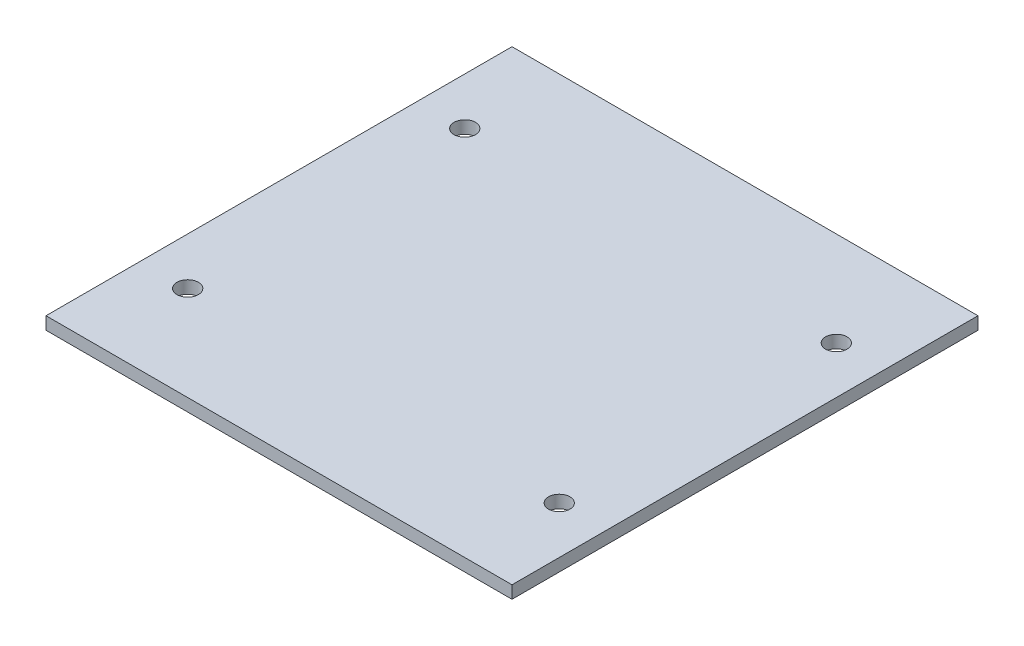
ISO-10303-21;
HEADER;
FILE_DESCRIPTION(('STEP AP214'),'2;1');
FILE_NAME('part.step','',(''),(''),'','','');
FILE_SCHEMA(('AUTOMOTIVE_DESIGN { 1 0 10303 214 1 1 1 1 }'));
ENDSEC;
DATA;
#1=APPLICATION_CONTEXT('core data for automotive mechanical design processes');
#2=APPLICATION_PROTOCOL_DEFINITION('international standard','automotive_design',2000,#1);
#3=PRODUCT_CONTEXT('',#1,'mechanical');
#4=PRODUCT('Part','Part','',(#3));
#5=PRODUCT_RELATED_PRODUCT_CATEGORY('part','',(#4));
#6=PRODUCT_DEFINITION_FORMATION('','',#4);
#7=PRODUCT_DEFINITION_CONTEXT('part definition',#1,'design');
#8=PRODUCT_DEFINITION('design','',#6,#7);
#9=PRODUCT_DEFINITION_SHAPE('','',#8);
#10=(LENGTH_UNIT() NAMED_UNIT(*) SI_UNIT(.MILLI.,.METRE.));
#11=(NAMED_UNIT(*) PLANE_ANGLE_UNIT() SI_UNIT($,.RADIAN.));
#12=(NAMED_UNIT(*) SI_UNIT($,.STERADIAN.) SOLID_ANGLE_UNIT());
#13=UNCERTAINTY_MEASURE_WITH_UNIT(LENGTH_MEASURE(1.E-05),#10,'distance_accuracy_value','');
#14=(GEOMETRIC_REPRESENTATION_CONTEXT(3) GLOBAL_UNCERTAINTY_ASSIGNED_CONTEXT((#13)) GLOBAL_UNIT_ASSIGNED_CONTEXT((#10,
#11,#12)) REPRESENTATION_CONTEXT('',''));
#15=CARTESIAN_POINT('',(0.,0.,0.));
#16=DIRECTION('',(0.,0.,1.));
#17=DIRECTION('',(1.,0.,0.));
#18=AXIS2_PLACEMENT_3D('',#15,#16,#17);
#19=CARTESIAN_POINT('',(37.,2.,-37.));
#20=DIRECTION('',(-1.,0.,0.));
#21=DIRECTION('',(0.,0.,1.));
#22=AXIS2_PLACEMENT_3D('',#19,#20,#21);
#23=PLANE('',#22);
#24=DIRECTION('',(0.,0.,-1.));
#25=VECTOR('',#24,1.);
#26=CARTESIAN_POINT('',(37.,0.,-37.));
#27=LINE('',#26,#25);
#28=CARTESIAN_POINT('',(37.,0.,37.));
#29=VERTEX_POINT('',#28);
#30=CARTESIAN_POINT('',(37.,0.,-37.));
#31=VERTEX_POINT('',#30);
#32=EDGE_CURVE('E96',#29,#31,#27,.T.);
#33=ORIENTED_EDGE('',*,*,#32,.T.);
#34=DIRECTION('',(0.,-1.,0.));
#35=VECTOR('',#34,1.);
#36=CARTESIAN_POINT('',(37.,2.,-37.));
#37=LINE('',#36,#35);
#38=CARTESIAN_POINT('',(37.,2.,-37.));
#39=VERTEX_POINT('',#38);
#40=EDGE_CURVE('E11',#39,#31,#37,.T.);
#41=ORIENTED_EDGE('',*,*,#40,.F.);
#42=DIRECTION('',(0.,0.,-1.));
#43=VECTOR('',#42,1.);
#44=CARTESIAN_POINT('',(37.,2.,-37.));
#45=LINE('',#44,#43);
#46=CARTESIAN_POINT('',(37.,2.,37.));
#47=VERTEX_POINT('',#46);
#48=EDGE_CURVE('E84',#47,#39,#45,.T.);
#49=ORIENTED_EDGE('',*,*,#48,.F.);
#50=DIRECTION('',(0.,-1.,0.));
#51=VECTOR('',#50,1.);
#52=CARTESIAN_POINT('',(37.,2.,37.));
#53=LINE('',#52,#51);
#54=EDGE_CURVE('E92',#47,#29,#53,.T.);
#55=ORIENTED_EDGE('',*,*,#54,.T.);
#56=EDGE_LOOP('',(#33,#41,#49,#55));
#57=FACE_BOUND('',#56,.T.);
#58=ADVANCED_FACE('F33',(#57),#23,.F.);
#59=CARTESIAN_POINT('',(-37.,2.,-37.));
#60=DIRECTION('',(0.,0.,1.));
#61=DIRECTION('',(1.,0.,0.));
#62=AXIS2_PLACEMENT_3D('',#59,#60,#61);
#63=PLANE('',#62);
#64=DIRECTION('',(-1.,0.,0.));
#65=VECTOR('',#64,1.);
#66=CARTESIAN_POINT('',(-37.,0.,-37.));
#67=LINE('',#66,#65);
#68=CARTESIAN_POINT('',(-37.,0.,-37.));
#69=VERTEX_POINT('',#68);
#70=EDGE_CURVE('E88',#31,#69,#67,.T.);
#71=ORIENTED_EDGE('',*,*,#70,.T.);
#72=DIRECTION('',(0.,-1.,0.));
#73=VECTOR('',#72,1.);
#74=CARTESIAN_POINT('',(-37.,2.,-37.));
#75=LINE('',#74,#73);
#76=CARTESIAN_POINT('',(-37.,2.,-37.));
#77=VERTEX_POINT('',#76);
#78=EDGE_CURVE('E41',#77,#69,#75,.T.);
#79=ORIENTED_EDGE('',*,*,#78,.F.);
#80=DIRECTION('',(-1.,0.,0.));
#81=VECTOR('',#80,1.);
#82=CARTESIAN_POINT('',(-37.,2.,-37.));
#83=LINE('',#82,#81);
#84=EDGE_CURVE('E79',#39,#77,#83,.T.);
#85=ORIENTED_EDGE('',*,*,#84,.F.);
#86=ORIENTED_EDGE('',*,*,#40,.T.);
#87=EDGE_LOOP('',(#71,#79,#85,#86));
#88=FACE_BOUND('',#87,.T.);
#89=ADVANCED_FACE('F87',(#88),#63,.F.);
#90=CARTESIAN_POINT('',(-37.,2.,-37.));
#91=DIRECTION('',(1.,0.,0.));
#92=DIRECTION('',(0.,0.,-1.));
#93=AXIS2_PLACEMENT_3D('',#90,#91,#92);
#94=PLANE('',#93);
#95=DIRECTION('',(0.,0.,1.));
#96=VECTOR('',#95,1.);
#97=CARTESIAN_POINT('',(-37.,0.,-37.));
#98=LINE('',#97,#96);
#99=CARTESIAN_POINT('',(-37.,0.,37.));
#100=VERTEX_POINT('',#99);
#101=EDGE_CURVE('E66',#69,#100,#98,.T.);
#102=ORIENTED_EDGE('',*,*,#101,.T.);
#103=DIRECTION('',(0.,-1.,0.));
#104=VECTOR('',#103,1.);
#105=CARTESIAN_POINT('',(-37.,2.,37.));
#106=LINE('',#105,#104);
#107=CARTESIAN_POINT('',(-37.,2.,37.));
#108=VERTEX_POINT('',#107);
#109=EDGE_CURVE('E89',#108,#100,#106,.T.);
#110=ORIENTED_EDGE('',*,*,#109,.F.);
#111=DIRECTION('',(0.,0.,1.));
#112=VECTOR('',#111,1.);
#113=CARTESIAN_POINT('',(-37.,2.,-37.));
#114=LINE('',#113,#112);
#115=EDGE_CURVE('E82',#77,#108,#114,.T.);
#116=ORIENTED_EDGE('',*,*,#115,.F.);
#117=ORIENTED_EDGE('',*,*,#78,.T.);
#118=EDGE_LOOP('',(#102,#110,#116,#117));
#119=FACE_BOUND('',#118,.T.);
#120=ADVANCED_FACE('F90',(#119),#94,.F.);
#121=CARTESIAN_POINT('',(-37.,2.,37.));
#122=DIRECTION('',(0.,0.,-1.));
#123=DIRECTION('',(-1.,0.,0.));
#124=AXIS2_PLACEMENT_3D('',#121,#122,#123);
#125=PLANE('',#124);
#126=DIRECTION('',(1.,0.,0.));
#127=VECTOR('',#126,1.);
#128=CARTESIAN_POINT('',(-37.,0.,37.));
#129=LINE('',#128,#127);
#130=EDGE_CURVE('E72',#100,#29,#129,.T.);
#131=ORIENTED_EDGE('',*,*,#130,.T.);
#132=ORIENTED_EDGE('',*,*,#54,.F.);
#133=DIRECTION('',(1.,0.,0.));
#134=VECTOR('',#133,1.);
#135=CARTESIAN_POINT('',(-37.,2.,37.));
#136=LINE('',#135,#134);
#137=EDGE_CURVE('E49',#108,#47,#136,.T.);
#138=ORIENTED_EDGE('',*,*,#137,.F.);
#139=ORIENTED_EDGE('',*,*,#109,.T.);
#140=EDGE_LOOP('',(#131,#132,#138,#139));
#141=FACE_BOUND('',#140,.T.);
#142=ADVANCED_FACE('F104',(#141),#125,.F.);
#143=CARTESIAN_POINT('',(37.,2.,37.));
#144=DIRECTION('',(0.,1.,0.));
#145=DIRECTION('',(0.,0.,1.));
#146=AXIS2_PLACEMENT_3D('',#143,#144,#145);
#147=PLANE('',#146);
#148=CARTESIAN_POINT('',(29.5,2.,22.));
#149=DIRECTION('',(0.,1.,0.));
#150=DIRECTION('',(0.,0.,1.));
#151=AXIS2_PLACEMENT_3D('',#148,#149,#150);
#152=CIRCLE('',#151,1.7);
#153=CARTESIAN_POINT('',(29.5,2.,23.7));
#154=VERTEX_POINT('',#153);
#155=EDGE_CURVE('E128',#154,#154,#152,.T.);
#156=ORIENTED_EDGE('',*,*,#155,.F.);
#157=EDGE_LOOP('',(#156));
#158=FACE_BOUND('',#157,.T.);
#159=CARTESIAN_POINT('',(-29.5,2.,22.));
#160=DIRECTION('',(0.,1.,0.));
#161=DIRECTION('',(0.,0.,1.));
#162=AXIS2_PLACEMENT_3D('',#159,#160,#161);
#163=CIRCLE('',#162,1.7);
#164=CARTESIAN_POINT('',(-29.5,2.,23.7));
#165=VERTEX_POINT('',#164);
#166=EDGE_CURVE('E122',#165,#165,#163,.T.);
#167=ORIENTED_EDGE('',*,*,#166,.F.);
#168=EDGE_LOOP('',(#167));
#169=FACE_BOUND('',#168,.T.);
#170=CARTESIAN_POINT('',(-29.5,2.,-22.));
#171=DIRECTION('',(0.,1.,0.));
#172=DIRECTION('',(0.,0.,1.));
#173=AXIS2_PLACEMENT_3D('',#170,#171,#172);
#174=CIRCLE('',#173,1.7);
#175=CARTESIAN_POINT('',(-29.5,2.,-20.3));
#176=VERTEX_POINT('',#175);
#177=EDGE_CURVE('E116',#176,#176,#174,.T.);
#178=ORIENTED_EDGE('',*,*,#177,.F.);
#179=EDGE_LOOP('',(#178));
#180=FACE_BOUND('',#179,.T.);
#181=CARTESIAN_POINT('',(29.5,2.,-22.));
#182=DIRECTION('',(0.,1.,0.));
#183=DIRECTION('',(0.,0.,1.));
#184=AXIS2_PLACEMENT_3D('',#181,#182,#183);
#185=CIRCLE('',#184,1.7);
#186=CARTESIAN_POINT('',(29.5,2.,-20.3));
#187=VERTEX_POINT('',#186);
#188=EDGE_CURVE('E110',#187,#187,#185,.T.);
#189=ORIENTED_EDGE('',*,*,#188,.F.);
#190=EDGE_LOOP('',(#189));
#191=FACE_BOUND('',#190,.T.);
#192=ORIENTED_EDGE('',*,*,#48,.T.);
#193=ORIENTED_EDGE('',*,*,#84,.T.);
#194=ORIENTED_EDGE('',*,*,#115,.T.);
#195=ORIENTED_EDGE('',*,*,#137,.T.);
#196=EDGE_LOOP('',(#192,#193,#194,#195));
#197=FACE_BOUND('',#196,.T.);
#198=ADVANCED_FACE('F80',(#158,#169,#180,#191,#197),#147,.T.);
#199=CARTESIAN_POINT('',(37.,0.,37.));
#200=DIRECTION('',(0.,1.,0.));
#201=DIRECTION('',(0.,0.,1.));
#202=AXIS2_PLACEMENT_3D('',#199,#200,#201);
#203=PLANE('',#202);
#204=CARTESIAN_POINT('',(29.5,0.,22.));
#205=DIRECTION('',(0.,1.,0.));
#206=DIRECTION('',(0.,0.,1.));
#207=AXIS2_PLACEMENT_3D('',#204,#205,#206);
#208=CIRCLE('',#207,1.7);
#209=CARTESIAN_POINT('',(29.5,0.,23.7));
#210=VERTEX_POINT('',#209);
#211=EDGE_CURVE('E125',#210,#210,#208,.T.);
#212=ORIENTED_EDGE('',*,*,#211,.T.);
#213=EDGE_LOOP('',(#212));
#214=FACE_BOUND('',#213,.T.);
#215=CARTESIAN_POINT('',(-29.5,0.,22.));
#216=DIRECTION('',(0.,1.,0.));
#217=DIRECTION('',(0.,0.,1.));
#218=AXIS2_PLACEMENT_3D('',#215,#216,#217);
#219=CIRCLE('',#218,1.7);
#220=CARTESIAN_POINT('',(-29.5,0.,23.7));
#221=VERTEX_POINT('',#220);
#222=EDGE_CURVE('E119',#221,#221,#219,.T.);
#223=ORIENTED_EDGE('',*,*,#222,.T.);
#224=EDGE_LOOP('',(#223));
#225=FACE_BOUND('',#224,.T.);
#226=CARTESIAN_POINT('',(-29.5,0.,-22.));
#227=DIRECTION('',(0.,1.,0.));
#228=DIRECTION('',(0.,0.,1.));
#229=AXIS2_PLACEMENT_3D('',#226,#227,#228);
#230=CIRCLE('',#229,1.7);
#231=CARTESIAN_POINT('',(-29.5,0.,-20.3));
#232=VERTEX_POINT('',#231);
#233=EDGE_CURVE('E113',#232,#232,#230,.T.);
#234=ORIENTED_EDGE('',*,*,#233,.T.);
#235=EDGE_LOOP('',(#234));
#236=FACE_BOUND('',#235,.T.);
#237=CARTESIAN_POINT('',(29.5,0.,-22.));
#238=DIRECTION('',(0.,1.,0.));
#239=DIRECTION('',(0.,0.,1.));
#240=AXIS2_PLACEMENT_3D('',#237,#238,#239);
#241=CIRCLE('',#240,1.7);
#242=CARTESIAN_POINT('',(29.5,0.,-20.3));
#243=VERTEX_POINT('',#242);
#244=EDGE_CURVE('E99',#243,#243,#241,.T.);
#245=ORIENTED_EDGE('',*,*,#244,.T.);
#246=EDGE_LOOP('',(#245));
#247=FACE_BOUND('',#246,.T.);
#248=ORIENTED_EDGE('',*,*,#32,.F.);
#249=ORIENTED_EDGE('',*,*,#130,.F.);
#250=ORIENTED_EDGE('',*,*,#101,.F.);
#251=ORIENTED_EDGE('',*,*,#70,.F.);
#252=EDGE_LOOP('',(#248,#249,#250,#251));
#253=FACE_BOUND('',#252,.T.);
#254=ADVANCED_FACE('F107',(#214,#225,#236,#247,#253),#203,.F.);
#255=CARTESIAN_POINT('',(29.5,0.,-22.));
#256=DIRECTION('',(0.,1.,0.));
#257=DIRECTION('',(0.,0.,1.));
#258=AXIS2_PLACEMENT_3D('',#255,#256,#257);
#259=CYLINDRICAL_SURFACE('',#258,1.7);
#260=ORIENTED_EDGE('',*,*,#244,.F.);
#261=EDGE_LOOP('',(#260));
#262=FACE_BOUND('',#261,.T.);
#263=ORIENTED_EDGE('',*,*,#188,.T.);
#264=EDGE_LOOP('',(#263));
#265=FACE_BOUND('',#264,.T.);
#266=ADVANCED_FACE('F152',(#262,#265),#259,.F.);
#267=CARTESIAN_POINT('',(-29.5,0.,-22.));
#268=DIRECTION('',(0.,1.,0.));
#269=DIRECTION('',(0.,0.,1.));
#270=AXIS2_PLACEMENT_3D('',#267,#268,#269);
#271=CYLINDRICAL_SURFACE('',#270,1.7);
#272=ORIENTED_EDGE('',*,*,#233,.F.);
#273=EDGE_LOOP('',(#272));
#274=FACE_BOUND('',#273,.T.);
#275=ORIENTED_EDGE('',*,*,#177,.T.);
#276=EDGE_LOOP('',(#275));
#277=FACE_BOUND('',#276,.T.);
#278=ADVANCED_FACE('F154',(#274,#277),#271,.F.);
#279=CARTESIAN_POINT('',(-29.5,0.,22.));
#280=DIRECTION('',(0.,1.,0.));
#281=DIRECTION('',(0.,0.,1.));
#282=AXIS2_PLACEMENT_3D('',#279,#280,#281);
#283=CYLINDRICAL_SURFACE('',#282,1.7);
#284=ORIENTED_EDGE('',*,*,#222,.F.);
#285=EDGE_LOOP('',(#284));
#286=FACE_BOUND('',#285,.T.);
#287=ORIENTED_EDGE('',*,*,#166,.T.);
#288=EDGE_LOOP('',(#287));
#289=FACE_BOUND('',#288,.T.);
#290=ADVANCED_FACE('F139',(#286,#289),#283,.F.);
#291=CARTESIAN_POINT('',(29.5,0.,22.));
#292=DIRECTION('',(0.,1.,0.));
#293=DIRECTION('',(0.,0.,1.));
#294=AXIS2_PLACEMENT_3D('',#291,#292,#293);
#295=CYLINDRICAL_SURFACE('',#294,1.7);
#296=ORIENTED_EDGE('',*,*,#211,.F.);
#297=EDGE_LOOP('',(#296));
#298=FACE_BOUND('',#297,.T.);
#299=ORIENTED_EDGE('',*,*,#155,.T.);
#300=EDGE_LOOP('',(#299));
#301=FACE_BOUND('',#300,.T.);
#302=ADVANCED_FACE('F136',(#298,#301),#295,.F.);
#303=CLOSED_SHELL('',(#58,#89,#120,#142,#198,#254,#266,#278,#290,#302));
#304=MANIFOLD_SOLID_BREP('B2',#303);
#305=ADVANCED_BREP_SHAPE_REPRESENTATION('',(#18,#304),#14);
#306=SHAPE_DEFINITION_REPRESENTATION(#9,#305);
ENDSEC;
END-ISO-10303-21;
